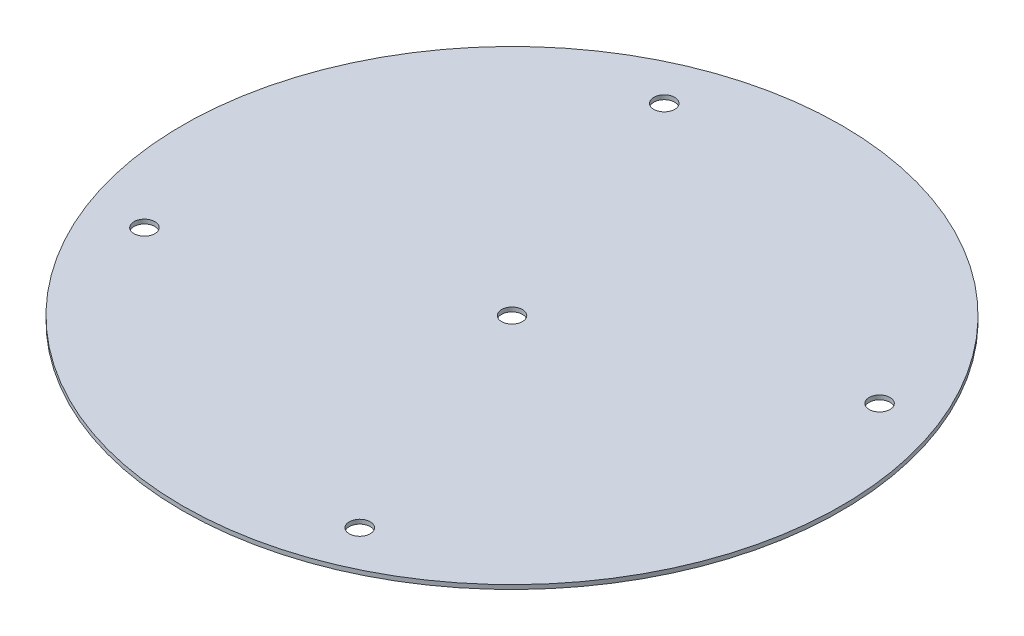
ISO-10303-21;
HEADER;
FILE_DESCRIPTION(('STEP AP214'),'2;1');
FILE_NAME('part.step','',(''),(''),'','','');
FILE_SCHEMA(('AUTOMOTIVE_DESIGN { 1 0 10303 214 1 1 1 1 }'));
ENDSEC;
DATA;
#1=APPLICATION_CONTEXT('core data for automotive mechanical design processes');
#2=APPLICATION_PROTOCOL_DEFINITION('international standard','automotive_design',2000,#1);
#3=PRODUCT_CONTEXT('',#1,'mechanical');
#4=PRODUCT('Part','Part','',(#3));
#5=PRODUCT_RELATED_PRODUCT_CATEGORY('part','',(#4));
#6=PRODUCT_DEFINITION_FORMATION('','',#4);
#7=PRODUCT_DEFINITION_CONTEXT('part definition',#1,'design');
#8=PRODUCT_DEFINITION('design','',#6,#7);
#9=PRODUCT_DEFINITION_SHAPE('','',#8);
#10=(LENGTH_UNIT() NAMED_UNIT(*) SI_UNIT(.MILLI.,.METRE.));
#11=(NAMED_UNIT(*) PLANE_ANGLE_UNIT() SI_UNIT($,.RADIAN.));
#12=(NAMED_UNIT(*) SI_UNIT($,.STERADIAN.) SOLID_ANGLE_UNIT());
#13=UNCERTAINTY_MEASURE_WITH_UNIT(LENGTH_MEASURE(1.E-05),#10,'distance_accuracy_value','');
#14=(GEOMETRIC_REPRESENTATION_CONTEXT(3) GLOBAL_UNCERTAINTY_ASSIGNED_CONTEXT((#13)) GLOBAL_UNIT_ASSIGNED_CONTEXT((#10,
#11,#12)) REPRESENTATION_CONTEXT('',''));
#15=CARTESIAN_POINT('',(0.,0.,0.));
#16=DIRECTION('',(0.,0.,1.));
#17=DIRECTION('',(1.,0.,0.));
#18=AXIS2_PLACEMENT_3D('',#15,#16,#17);
#19=CARTESIAN_POINT('',(0.,0.,0.));
#20=DIRECTION('',(0.,1.,0.));
#21=DIRECTION('',(0.,0.,1.));
#22=AXIS2_PLACEMENT_3D('',#19,#20,#21);
#23=PLANE('',#22);
#24=CARTESIAN_POINT('',(0.,0.,0.));
#25=DIRECTION('',(0.,1.,0.));
#26=DIRECTION('',(0.,0.,1.));
#27=AXIS2_PLACEMENT_3D('',#24,#25,#26);
#28=CIRCLE('',#27,2.45745);
#29=CARTESIAN_POINT('',(0.,0.,2.45745));
#30=VERTEX_POINT('',#29);
#31=EDGE_CURVE('E71',#30,#30,#28,.T.);
#32=ORIENTED_EDGE('',*,*,#31,.T.);
#33=EDGE_LOOP('',(#32));
#34=FACE_BOUND('',#33,.T.);
#35=CARTESIAN_POINT('',(61.1608250522469,0.,-25.3336432225696));
#36=DIRECTION('',(0.,1.,0.));
#37=DIRECTION('',(0.,0.,1.));
#38=AXIS2_PLACEMENT_3D('',#35,#36,#37);
#39=CIRCLE('',#38,2.45744999999999);
#40=CARTESIAN_POINT('',(61.1608250522469,0.,-22.8761932225696));
#41=VERTEX_POINT('',#40);
#42=EDGE_CURVE('E65',#41,#41,#39,.T.);
#43=ORIENTED_EDGE('',*,*,#42,.T.);
#44=EDGE_LOOP('',(#43));
#45=FACE_BOUND('',#44,.T.);
#46=CARTESIAN_POINT('',(25.333643222569,0.,61.1608250522472));
#47=DIRECTION('',(0.,1.,0.));
#48=DIRECTION('',(0.,0.,1.));
#49=AXIS2_PLACEMENT_3D('',#46,#47,#48);
#50=CIRCLE('',#49,2.45745);
#51=CARTESIAN_POINT('',(25.333643222569,0.,63.6182750522472));
#52=VERTEX_POINT('',#51);
#53=EDGE_CURVE('E59',#52,#52,#50,.T.);
#54=ORIENTED_EDGE('',*,*,#53,.T.);
#55=EDGE_LOOP('',(#54));
#56=FACE_BOUND('',#55,.T.);
#57=CARTESIAN_POINT('',(-61.1608250522471,0.,25.3336432225692));
#58=DIRECTION('',(0.,1.,0.));
#59=DIRECTION('',(0.,0.,1.));
#60=AXIS2_PLACEMENT_3D('',#57,#58,#59);
#61=CIRCLE('',#60,2.45745);
#62=CARTESIAN_POINT('',(-61.1608250522471,0.,27.7910932225692));
#63=VERTEX_POINT('',#62);
#64=EDGE_CURVE('E53',#63,#63,#61,.T.);
#65=ORIENTED_EDGE('',*,*,#64,.T.);
#66=EDGE_LOOP('',(#65));
#67=FACE_BOUND('',#66,.T.);
#68=CARTESIAN_POINT('',(-25.333643222569,0.,-61.1608250522472));
#69=DIRECTION('',(0.,1.,0.));
#70=DIRECTION('',(0.,0.,1.));
#71=AXIS2_PLACEMENT_3D('',#68,#69,#70);
#72=CIRCLE('',#71,2.45745);
#73=CARTESIAN_POINT('',(-25.333643222569,0.,-58.7033750522472));
#74=VERTEX_POINT('',#73);
#75=EDGE_CURVE('E44',#74,#74,#72,.T.);
#76=ORIENTED_EDGE('',*,*,#75,.T.);
#77=EDGE_LOOP('',(#76));
#78=FACE_BOUND('',#77,.T.);
#79=CARTESIAN_POINT('',(0.,0.,0.));
#80=DIRECTION('',(0.,-1.,0.));
#81=DIRECTION('',(0.,0.,-1.));
#82=AXIS2_PLACEMENT_3D('',#79,#80,#81);
#83=CIRCLE('',#82,77.55);
#84=CARTESIAN_POINT('',(0.,0.,-77.55));
#85=VERTEX_POINT('',#84);
#86=EDGE_CURVE('E10',#85,#85,#83,.T.);
#87=ORIENTED_EDGE('',*,*,#86,.T.);
#88=EDGE_LOOP('',(#87));
#89=FACE_BOUND('',#88,.T.);
#90=ADVANCED_FACE('F34',(#34,#45,#56,#67,#78,#89),#23,.F.);
#91=CARTESIAN_POINT('',(0.,-0.0500000000000096,0.));
#92=DIRECTION('',(0.,-1.,0.));
#93=DIRECTION('',(0.,0.,-1.));
#94=AXIS2_PLACEMENT_3D('',#91,#92,#93);
#95=CYLINDRICAL_SURFACE('',#94,77.55);
#96=ORIENTED_EDGE('',*,*,#86,.F.);
#97=EDGE_LOOP('',(#96));
#98=FACE_BOUND('',#97,.T.);
#99=CARTESIAN_POINT('',(0.,0.99999999999999,0.));
#100=DIRECTION('',(0.,-1.,0.));
#101=DIRECTION('',(0.,0.,-1.));
#102=AXIS2_PLACEMENT_3D('',#99,#100,#101);
#103=CIRCLE('',#102,77.55);
#104=CARTESIAN_POINT('',(0.,0.99999999999999,-77.55));
#105=VERTEX_POINT('',#104);
#106=EDGE_CURVE('E40',#105,#105,#103,.T.);
#107=ORIENTED_EDGE('',*,*,#106,.T.);
#108=EDGE_LOOP('',(#107));
#109=FACE_BOUND('',#108,.T.);
#110=ADVANCED_FACE('F84',(#98,#109),#95,.T.);
#111=CARTESIAN_POINT('',(0.,0.99999999999999,77.55));
#112=DIRECTION('',(0.,-1.,0.));
#113=DIRECTION('',(0.,0.,-1.));
#114=AXIS2_PLACEMENT_3D('',#111,#112,#113);
#115=PLANE('',#114);
#116=CARTESIAN_POINT('',(0.,0.99999999999999,0.));
#117=DIRECTION('',(0.,1.,0.));
#118=DIRECTION('',(0.,0.,1.));
#119=AXIS2_PLACEMENT_3D('',#116,#117,#118);
#120=CIRCLE('',#119,2.45745);
#121=CARTESIAN_POINT('',(0.,0.99999999999999,2.45745));
#122=VERTEX_POINT('',#121);
#123=EDGE_CURVE('E74',#122,#122,#120,.T.);
#124=ORIENTED_EDGE('',*,*,#123,.F.);
#125=EDGE_LOOP('',(#124));
#126=FACE_BOUND('',#125,.T.);
#127=CARTESIAN_POINT('',(61.1608250522469,0.99999999999999,-25.3336432225696));
#128=DIRECTION('',(0.,1.,0.));
#129=DIRECTION('',(0.,0.,1.));
#130=AXIS2_PLACEMENT_3D('',#127,#128,#129);
#131=CIRCLE('',#130,2.45744999999999);
#132=CARTESIAN_POINT('',(61.1608250522469,0.99999999999999,-22.8761932225696));
#133=VERTEX_POINT('',#132);
#134=EDGE_CURVE('E68',#133,#133,#131,.T.);
#135=ORIENTED_EDGE('',*,*,#134,.F.);
#136=EDGE_LOOP('',(#135));
#137=FACE_BOUND('',#136,.T.);
#138=CARTESIAN_POINT('',(25.333643222569,0.99999999999999,61.1608250522472));
#139=DIRECTION('',(0.,1.,0.));
#140=DIRECTION('',(0.,0.,1.));
#141=AXIS2_PLACEMENT_3D('',#138,#139,#140);
#142=CIRCLE('',#141,2.45745);
#143=CARTESIAN_POINT('',(25.333643222569,0.99999999999999,63.6182750522472));
#144=VERTEX_POINT('',#143);
#145=EDGE_CURVE('E62',#144,#144,#142,.T.);
#146=ORIENTED_EDGE('',*,*,#145,.F.);
#147=EDGE_LOOP('',(#146));
#148=FACE_BOUND('',#147,.T.);
#149=CARTESIAN_POINT('',(-61.1608250522471,0.99999999999999,25.3336432225692));
#150=DIRECTION('',(0.,1.,0.));
#151=DIRECTION('',(0.,0.,1.));
#152=AXIS2_PLACEMENT_3D('',#149,#150,#151);
#153=CIRCLE('',#152,2.45745);
#154=CARTESIAN_POINT('',(-61.1608250522471,0.99999999999999,27.7910932225692));
#155=VERTEX_POINT('',#154);
#156=EDGE_CURVE('E56',#155,#155,#153,.T.);
#157=ORIENTED_EDGE('',*,*,#156,.F.);
#158=EDGE_LOOP('',(#157));
#159=FACE_BOUND('',#158,.T.);
#160=CARTESIAN_POINT('',(-25.333643222569,0.99999999999999,-61.1608250522472));
#161=DIRECTION('',(0.,1.,0.));
#162=DIRECTION('',(0.,0.,1.));
#163=AXIS2_PLACEMENT_3D('',#160,#161,#162);
#164=CIRCLE('',#163,2.45745);
#165=CARTESIAN_POINT('',(-25.333643222569,0.99999999999999,-58.7033750522472));
#166=VERTEX_POINT('',#165);
#167=EDGE_CURVE('E48',#166,#166,#164,.T.);
#168=ORIENTED_EDGE('',*,*,#167,.F.);
#169=EDGE_LOOP('',(#168));
#170=FACE_BOUND('',#169,.T.);
#171=ORIENTED_EDGE('',*,*,#106,.F.);
#172=EDGE_LOOP('',(#171));
#173=FACE_BOUND('',#172,.T.);
#174=ADVANCED_FACE('F80',(#126,#137,#148,#159,#170,#173),#115,.F.);
#175=CARTESIAN_POINT('',(-25.333643222569,0.99999999999999,-61.1608250522472));
#176=DIRECTION('',(0.,1.,0.));
#177=DIRECTION('',(0.,0.,1.));
#178=AXIS2_PLACEMENT_3D('',#175,#176,#177);
#179=CYLINDRICAL_SURFACE('',#178,2.45745);
#180=ORIENTED_EDGE('',*,*,#75,.F.);
#181=EDGE_LOOP('',(#180));
#182=FACE_BOUND('',#181,.T.);
#183=ORIENTED_EDGE('',*,*,#167,.T.);
#184=EDGE_LOOP('',(#183));
#185=FACE_BOUND('',#184,.T.);
#186=ADVANCED_FACE('F83',(#182,#185),#179,.F.);
#187=CARTESIAN_POINT('',(-61.1608250522471,0.99999999999999,25.3336432225692));
#188=DIRECTION('',(0.,1.,0.));
#189=DIRECTION('',(0.,0.,1.));
#190=AXIS2_PLACEMENT_3D('',#187,#188,#189);
#191=CYLINDRICAL_SURFACE('',#190,2.45745);
#192=ORIENTED_EDGE('',*,*,#64,.F.);
#193=EDGE_LOOP('',(#192));
#194=FACE_BOUND('',#193,.T.);
#195=ORIENTED_EDGE('',*,*,#156,.T.);
#196=EDGE_LOOP('',(#195));
#197=FACE_BOUND('',#196,.T.);
#198=ADVANCED_FACE('F96',(#194,#197),#191,.F.);
#199=CARTESIAN_POINT('',(25.333643222569,0.99999999999999,61.1608250522472));
#200=DIRECTION('',(0.,1.,0.));
#201=DIRECTION('',(0.,0.,1.));
#202=AXIS2_PLACEMENT_3D('',#199,#200,#201);
#203=CYLINDRICAL_SURFACE('',#202,2.45745);
#204=ORIENTED_EDGE('',*,*,#53,.F.);
#205=EDGE_LOOP('',(#204));
#206=FACE_BOUND('',#205,.T.);
#207=ORIENTED_EDGE('',*,*,#145,.T.);
#208=EDGE_LOOP('',(#207));
#209=FACE_BOUND('',#208,.T.);
#210=ADVANCED_FACE('F102',(#206,#209),#203,.F.);
#211=CARTESIAN_POINT('',(61.1608250522469,0.99999999999999,-25.3336432225696));
#212=DIRECTION('',(0.,1.,0.));
#213=DIRECTION('',(0.,0.,1.));
#214=AXIS2_PLACEMENT_3D('',#211,#212,#213);
#215=CYLINDRICAL_SURFACE('',#214,2.45744999999999);
#216=ORIENTED_EDGE('',*,*,#42,.F.);
#217=EDGE_LOOP('',(#216));
#218=FACE_BOUND('',#217,.T.);
#219=ORIENTED_EDGE('',*,*,#134,.T.);
#220=EDGE_LOOP('',(#219));
#221=FACE_BOUND('',#220,.T.);
#222=ADVANCED_FACE('F124',(#218,#221),#215,.F.);
#223=CARTESIAN_POINT('',(0.,0.99999999999999,0.));
#224=DIRECTION('',(0.,1.,0.));
#225=DIRECTION('',(0.,0.,1.));
#226=AXIS2_PLACEMENT_3D('',#223,#224,#225);
#227=CYLINDRICAL_SURFACE('',#226,2.45745);
#228=ORIENTED_EDGE('',*,*,#31,.F.);
#229=EDGE_LOOP('',(#228));
#230=FACE_BOUND('',#229,.T.);
#231=ORIENTED_EDGE('',*,*,#123,.T.);
#232=EDGE_LOOP('',(#231));
#233=FACE_BOUND('',#232,.T.);
#234=ADVANCED_FACE('F78',(#230,#233),#227,.F.);
#235=CLOSED_SHELL('',(#90,#110,#174,#186,#198,#210,#222,#234));
#236=MANIFOLD_SOLID_BREP('B2',#235);
#237=ADVANCED_BREP_SHAPE_REPRESENTATION('',(#18,#236),#14);
#238=SHAPE_DEFINITION_REPRESENTATION(#9,#237);
ENDSEC;
END-ISO-10303-21;
